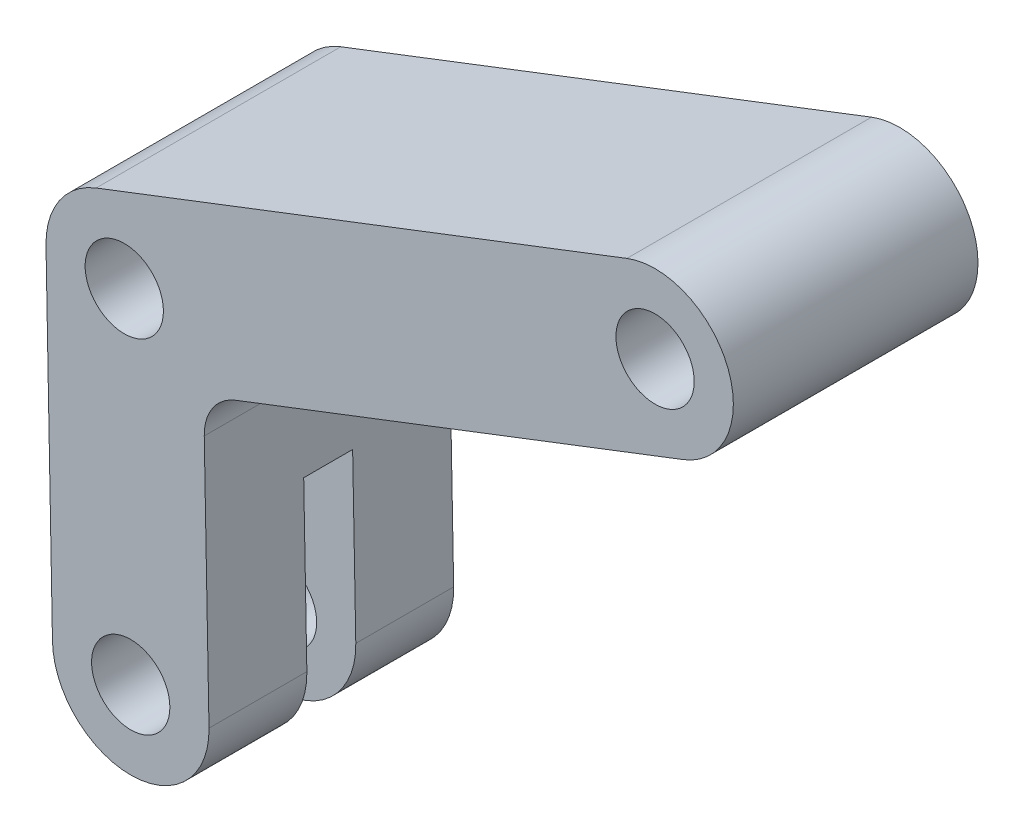
ISO-10303-21;
HEADER;
FILE_DESCRIPTION(('STEP AP214'),'2;1');
FILE_NAME('part.step','',(''),(''),'','','');
FILE_SCHEMA(('AUTOMOTIVE_DESIGN { 1 0 10303 214 1 1 1 1 }'));
ENDSEC;
DATA;
#1=APPLICATION_CONTEXT('core data for automotive mechanical design processes');
#2=APPLICATION_PROTOCOL_DEFINITION('international standard','automotive_design',2000,#1);
#3=PRODUCT_CONTEXT('',#1,'mechanical');
#4=PRODUCT('Part','Part','',(#3));
#5=PRODUCT_RELATED_PRODUCT_CATEGORY('part','',(#4));
#6=PRODUCT_DEFINITION_FORMATION('','',#4);
#7=PRODUCT_DEFINITION_CONTEXT('part definition',#1,'design');
#8=PRODUCT_DEFINITION('design','',#6,#7);
#9=PRODUCT_DEFINITION_SHAPE('','',#8);
#10=(LENGTH_UNIT() NAMED_UNIT(*) SI_UNIT(.MILLI.,.METRE.));
#11=(NAMED_UNIT(*) PLANE_ANGLE_UNIT() SI_UNIT($,.RADIAN.));
#12=(NAMED_UNIT(*) SI_UNIT($,.STERADIAN.) SOLID_ANGLE_UNIT());
#13=UNCERTAINTY_MEASURE_WITH_UNIT(LENGTH_MEASURE(1.E-05),#10,'distance_accuracy_value','');
#14=(GEOMETRIC_REPRESENTATION_CONTEXT(3) GLOBAL_UNCERTAINTY_ASSIGNED_CONTEXT((#13)) GLOBAL_UNIT_ASSIGNED_CONTEXT((#10,
#11,#12)) REPRESENTATION_CONTEXT('',''));
#15=CARTESIAN_POINT('',(0.,0.,0.));
#16=DIRECTION('',(0.,0.,1.));
#17=DIRECTION('',(1.,0.,0.));
#18=AXIS2_PLACEMENT_3D('',#15,#16,#17);
#19=CARTESIAN_POINT('',(0.,0.,-25.));
#20=DIRECTION('',(0.,0.,1.));
#21=DIRECTION('',(1.,0.,0.));
#22=AXIS2_PLACEMENT_3D('',#19,#20,#21);
#23=CYLINDRICAL_SURFACE('',#22,8.);
#24=CARTESIAN_POINT('',(0.,0.,-15.));
#25=DIRECTION('',(0.,0.,-1.));
#26=DIRECTION('',(0.,1.,0.));
#27=AXIS2_PLACEMENT_3D('',#24,#25,#26);
#28=CIRCLE('',#27,8.);
#29=CARTESIAN_POINT('',(-8.,0.,-15.));
#30=VERTEX_POINT('',#29);
#31=CARTESIAN_POINT('',(7.99855499034279,0.152046264217347,-15.));
#32=VERTEX_POINT('',#31);
#33=EDGE_CURVE('E156',#30,#32,#28,.F.);
#34=ORIENTED_EDGE('',*,*,#33,.F.);
#35=DIRECTION('',(0.,0.,1.));
#36=VECTOR('',#35,1.);
#37=CARTESIAN_POINT('',(-8.,0.,-25.));
#38=LINE('',#37,#36);
#39=CARTESIAN_POINT('',(-8.,0.,-25.));
#40=VERTEX_POINT('',#39);
#41=EDGE_CURVE('E220',#40,#30,#38,.T.);
#42=ORIENTED_EDGE('',*,*,#41,.F.);
#43=CARTESIAN_POINT('',(0.,0.,-25.));
#44=DIRECTION('',(0.,0.,1.));
#45=DIRECTION('',(1.,0.,0.));
#46=AXIS2_PLACEMENT_3D('',#43,#44,#45);
#47=CIRCLE('',#46,8.);
#48=CARTESIAN_POINT('',(7.99855499034279,0.152046264217347,-25.));
#49=VERTEX_POINT('',#48);
#50=EDGE_CURVE('E182',#40,#49,#47,.T.);
#51=ORIENTED_EDGE('',*,*,#50,.T.);
#52=DIRECTION('',(0.,0.,1.));
#53=VECTOR('',#52,1.);
#54=CARTESIAN_POINT('',(7.99855499034279,0.152046264217347,-25.));
#55=LINE('',#54,#53);
#56=EDGE_CURVE('E216',#49,#32,#55,.T.);
#57=ORIENTED_EDGE('',*,*,#56,.T.);
#58=EDGE_LOOP('',(#34,#42,#51,#57));
#59=FACE_BOUND('',#58,.T.);
#60=ADVANCED_FACE('F34',(#59),#23,.T.);
#61=CARTESIAN_POINT('',(0.,0.,-25.));
#62=DIRECTION('',(0.,0.,1.));
#63=DIRECTION('',(1.,0.,0.));
#64=AXIS2_PLACEMENT_3D('',#61,#62,#63);
#65=CYLINDRICAL_SURFACE('',#64,4.);
#66=CARTESIAN_POINT('',(0.,0.,-15.));
#67=DIRECTION('',(0.,0.,-1.));
#68=DIRECTION('',(0.,1.,0.));
#69=AXIS2_PLACEMENT_3D('',#66,#67,#68);
#70=CIRCLE('',#69,4.);
#71=CARTESIAN_POINT('',(0.,4.,-15.));
#72=VERTEX_POINT('',#71);
#73=EDGE_CURVE('E147',#72,#72,#70,.F.);
#74=ORIENTED_EDGE('',*,*,#73,.T.);
#75=EDGE_LOOP('',(#74));
#76=FACE_BOUND('',#75,.T.);
#77=CARTESIAN_POINT('',(0.,0.,-25.));
#78=DIRECTION('',(0.,0.,1.));
#79=DIRECTION('',(1.,0.,0.));
#80=AXIS2_PLACEMENT_3D('',#77,#78,#79);
#81=CIRCLE('',#80,4.);
#82=CARTESIAN_POINT('',(4.,0.,-25.));
#83=VERTEX_POINT('',#82);
#84=EDGE_CURVE('E159',#83,#83,#81,.T.);
#85=ORIENTED_EDGE('',*,*,#84,.F.);
#86=EDGE_LOOP('',(#85));
#87=FACE_BOUND('',#86,.T.);
#88=ADVANCED_FACE('F287',(#76,#87),#65,.F.);
#89=CARTESIAN_POINT('',(-8.85477215853256,22.9910407792631,-25.));
#90=DIRECTION('',(-0.359405611277905,0.9331814435478,0.));
#91=DIRECTION('',(-0.9331814435478,-0.359405611277905,0.));
#92=AXIS2_PLACEMENT_3D('',#89,#90,#91);
#93=PLANE('',#92);
#94=DIRECTION('',(-0.9331814435478,-0.359405611277905,0.));
#95=VECTOR('',#94,1.);
#96=CARTESIAN_POINT('',(-8.85477215853256,22.9910407792631,0.));
#97=LINE('',#96,#95);
#98=CARTESIAN_POINT('',(56.4552448902232,48.1445484516176,0.));
#99=VERTEX_POINT('',#98);
#100=CARTESIAN_POINT('',(10.7137090775173,30.5276479514807,0.));
#101=VERTEX_POINT('',#100);
#102=EDGE_CURVE('E197',#99,#101,#97,.T.);
#103=ORIENTED_EDGE('',*,*,#102,.T.);
#104=DIRECTION('',(0.,0.,1.));
#105=VECTOR('',#104,1.);
#106=CARTESIAN_POINT('',(10.7137090775173,30.5276479514807,-25.));
#107=LINE('',#106,#105);
#108=CARTESIAN_POINT('',(10.7137090775173,30.5276479514807,-25.));
#109=VERTEX_POINT('',#108);
#110=EDGE_CURVE('E57',#101,#109,#107,.F.);
#111=ORIENTED_EDGE('',*,*,#110,.T.);
#112=DIRECTION('',(-0.9331814435478,-0.359405611277905,0.));
#113=VECTOR('',#112,1.);
#114=CARTESIAN_POINT('',(-8.85477215853256,22.9910407792631,-25.));
#115=LINE('',#114,#113);
#116=CARTESIAN_POINT('',(56.4552448902232,48.1445484516176,-25.));
#117=VERTEX_POINT('',#116);
#118=EDGE_CURVE('E169',#117,#109,#115,.T.);
#119=ORIENTED_EDGE('',*,*,#118,.F.);
#120=DIRECTION('',(0.,0.,1.));
#121=VECTOR('',#120,1.);
#122=CARTESIAN_POINT('',(56.4552448902232,48.1445484516176,-25.));
#123=LINE('',#122,#121);
#124=EDGE_CURVE('E188',#117,#99,#123,.T.);
#125=ORIENTED_EDGE('',*,*,#124,.T.);
#126=EDGE_LOOP('',(#103,#111,#119,#125));
#127=FACE_BOUND('',#126,.T.);
#128=ADVANCED_FACE('F261',(#127),#93,.F.);
#129=CARTESIAN_POINT('',(7.99855499034279,0.152046264217347,-25.));
#130=DIRECTION('',(0.999819373792849,0.0190057830271684,0.));
#131=DIRECTION('',(-0.0190057830271684,0.999819373792849,0.));
#132=AXIS2_PLACEMENT_3D('',#129,#130,#131);
#133=PLANE('',#132);
#134=DIRECTION('',(-0.0190057830271684,0.999819373792849,0.));
#135=VECTOR('',#134,1.);
#136=CARTESIAN_POINT('',(7.99855499034279,0.152046264217349,-15.));
#137=LINE('',#136,#135);
#138=CARTESIAN_POINT('',(7.67545032388291,17.1493099301067,-15.));
#139=VERTEX_POINT('',#138);
#140=EDGE_CURVE('E136',#32,#139,#137,.T.);
#141=ORIENTED_EDGE('',*,*,#140,.F.);
#142=ORIENTED_EDGE('',*,*,#56,.F.);
#143=DIRECTION('',(-0.0190057830271684,0.999819373792849,0.));
#144=VECTOR('',#143,1.);
#145=CARTESIAN_POINT('',(7.99855499034279,0.152046264217347,-25.));
#146=LINE('',#145,#144);
#147=CARTESIAN_POINT('',(7.51164026494254,25.7667118186058,-25.));
#148=VERTEX_POINT('',#147);
#149=EDGE_CURVE('E185',#49,#148,#146,.T.);
#150=ORIENTED_EDGE('',*,*,#149,.T.);
#151=DIRECTION('',(0.,0.,1.));
#152=VECTOR('',#151,1.);
#153=CARTESIAN_POINT('',(7.51164026494254,25.7667118186058,-25.));
#154=LINE('',#153,#152);
#155=CARTESIAN_POINT('',(7.51164026494254,25.7667118186058,0.));
#156=VERTEX_POINT('',#155);
#157=EDGE_CURVE('E219',#148,#156,#154,.T.);
#158=ORIENTED_EDGE('',*,*,#157,.T.);
#159=DIRECTION('',(-0.0190057830271684,0.999819373792849,0.));
#160=VECTOR('',#159,1.);
#161=CARTESIAN_POINT('',(7.99855499034279,0.152046264217347,0.));
#162=LINE('',#161,#160);
#163=CARTESIAN_POINT('',(7.99855499034279,0.152046264217347,0.));
#164=VERTEX_POINT('',#163);
#165=EDGE_CURVE('E163',#164,#156,#162,.T.);
#166=ORIENTED_EDGE('',*,*,#165,.F.);
#167=CARTESIAN_POINT('',(7.99855499034279,0.152046264217347,-10.));
#168=VERTEX_POINT('',#167);
#169=EDGE_CURVE('E146',#168,#164,#55,.T.);
#170=ORIENTED_EDGE('',*,*,#169,.F.);
#171=DIRECTION('',(0.0190057830271684,-0.999819373792849,0.));
#172=VECTOR('',#171,1.);
#173=CARTESIAN_POINT('',(7.99855499034279,0.152046264217349,-10.));
#174=LINE('',#173,#172);
#175=CARTESIAN_POINT('',(7.67545032388291,17.1493099301067,-10.));
#176=VERTEX_POINT('',#175);
#177=EDGE_CURVE('E140',#176,#168,#174,.T.);
#178=ORIENTED_EDGE('',*,*,#177,.F.);
#179=DIRECTION('',(0.,0.,1.));
#180=VECTOR('',#179,1.);
#181=CARTESIAN_POINT('',(7.67545032388291,17.1493099301067,-25.));
#182=LINE('',#181,#180);
#183=EDGE_CURVE('E126',#139,#176,#182,.T.);
#184=ORIENTED_EDGE('',*,*,#183,.F.);
#185=EDGE_LOOP('',(#141,#142,#150,#158,#166,#170,#178,#184));
#186=FACE_BOUND('',#185,.T.);
#187=ADVANCED_FACE('F144',(#186),#133,.T.);
#188=CARTESIAN_POINT('',(0.,0.,-10.));
#189=DIRECTION('',(0.,0.,1.));
#190=DIRECTION('',(0.,-1.,0.));
#191=AXIS2_PLACEMENT_3D('',#188,#189,#190);
#192=CIRCLE('',#191,8.);
#193=CARTESIAN_POINT('',(-8.,0.,-10.));
#194=VERTEX_POINT('',#193);
#195=EDGE_CURVE('E49',#168,#194,#192,.F.);
#196=ORIENTED_EDGE('',*,*,#195,.F.);
#197=ORIENTED_EDGE('',*,*,#169,.T.);
#198=CARTESIAN_POINT('',(0.,0.,0.));
#199=DIRECTION('',(0.,0.,1.));
#200=DIRECTION('',(1.,0.,0.));
#201=AXIS2_PLACEMENT_3D('',#198,#199,#200);
#202=CIRCLE('',#201,8.);
#203=CARTESIAN_POINT('',(-8.,0.,0.));
#204=VERTEX_POINT('',#203);
#205=EDGE_CURVE('E211',#204,#164,#202,.T.);
#206=ORIENTED_EDGE('',*,*,#205,.F.);
#207=EDGE_CURVE('E223',#194,#204,#38,.T.);
#208=ORIENTED_EDGE('',*,*,#207,.F.);
#209=EDGE_LOOP('',(#196,#197,#206,#208));
#210=FACE_BOUND('',#209,.T.);
#211=ADVANCED_FACE('F277',(#210),#23,.T.);
#212=CARTESIAN_POINT('',(-7.99709752059199,-0.152352915552517,-25.));
#213=DIRECTION('',(0.999818578580134,0.0190475700812738,0.));
#214=DIRECTION('',(-0.0190475700812738,0.999818578580134,0.));
#215=AXIS2_PLACEMENT_3D('',#212,#213,#214);
#216=PLANE('',#215);
#217=ORIENTED_EDGE('',*,*,#41,.T.);
#218=DIRECTION('',(-0.0190475700812738,0.999818578580134,0.));
#219=VECTOR('',#218,1.);
#220=CARTESIAN_POINT('',(-7.99709752059199,-0.152352915552516,-15.));
#221=LINE('',#220,#219);
#222=CARTESIAN_POINT('',(-8.32090621197365,16.8445629203098,-15.));
#223=VERTEX_POINT('',#222);
#224=EDGE_CURVE('E150',#30,#223,#221,.T.);
#225=ORIENTED_EDGE('',*,*,#224,.T.);
#226=DIRECTION('',(0.,0.,1.));
#227=VECTOR('',#226,1.);
#228=CARTESIAN_POINT('',(-8.32090621197365,16.8445629203098,-25.));
#229=LINE('',#228,#227);
#230=CARTESIAN_POINT('',(-8.32090621197365,16.8445629203098,-10.));
#231=VERTEX_POINT('',#230);
#232=EDGE_CURVE('E11',#223,#231,#229,.T.);
#233=ORIENTED_EDGE('',*,*,#232,.T.);
#234=DIRECTION('',(0.0190475700812738,-0.999818578580134,0.));
#235=VECTOR('',#234,1.);
#236=CARTESIAN_POINT('',(-7.99709752059199,-0.152352915552515,-10.));
#237=LINE('',#236,#235);
#238=EDGE_CURVE('E141',#231,#194,#237,.T.);
#239=ORIENTED_EDGE('',*,*,#238,.T.);
#240=ORIENTED_EDGE('',*,*,#207,.T.);
#241=DIRECTION('',(-0.0190475700812738,0.999818578580134,0.));
#242=VECTOR('',#241,1.);
#243=CARTESIAN_POINT('',(-7.99709752059199,-0.152352915552517,0.));
#244=LINE('',#243,#242);
#245=CARTESIAN_POINT('',(-8.65854862864108,34.5676194393498,0.));
#246=VERTEX_POINT('',#245);
#247=EDGE_CURVE('E208',#204,#246,#244,.T.);
#248=ORIENTED_EDGE('',*,*,#247,.T.);
#249=DIRECTION('',(0.,0.,1.));
#250=VECTOR('',#249,1.);
#251=CARTESIAN_POINT('',(-8.65854862864108,34.5676194393498,-25.));
#252=LINE('',#251,#250);
#253=CARTESIAN_POINT('',(-8.65854862864108,34.5676194393498,-25.));
#254=VERTEX_POINT('',#253);
#255=EDGE_CURVE('E224',#254,#246,#252,.T.);
#256=ORIENTED_EDGE('',*,*,#255,.F.);
#257=DIRECTION('',(-0.0190475700812738,0.999818578580134,0.));
#258=VECTOR('',#257,1.);
#259=CARTESIAN_POINT('',(-7.99709752059199,-0.152352915552517,-25.));
#260=LINE('',#259,#258);
#261=EDGE_CURVE('E180',#40,#254,#260,.T.);
#262=ORIENTED_EDGE('',*,*,#261,.F.);
#263=EDGE_LOOP('',(#217,#225,#233,#239,#240,#248,#256,#262));
#264=FACE_BOUND('',#263,.T.);
#265=ADVANCED_FACE('F247',(#264),#216,.F.);
#266=CARTESIAN_POINT('',(-0.660000000000004,34.72,-25.));
#267=DIRECTION('',(0.,0.,1.));
#268=DIRECTION('',(1.,0.,0.));
#269=AXIS2_PLACEMENT_3D('',#266,#267,#268);
#270=CYLINDRICAL_SURFACE('',#269,7.99999999999999);
#271=CARTESIAN_POINT('',(-0.660000000000004,34.72,0.));
#272=DIRECTION('',(0.,0.,1.));
#273=DIRECTION('',(1.,0.,0.));
#274=AXIS2_PLACEMENT_3D('',#271,#272,#273);
#275=CIRCLE('',#274,7.99999999999999);
#276=CARTESIAN_POINT('',(-3.53524489022324,42.1854515483824,0.));
#277=VERTEX_POINT('',#276);
#278=EDGE_CURVE('E205',#277,#246,#275,.T.);
#279=ORIENTED_EDGE('',*,*,#278,.F.);
#280=DIRECTION('',(0.,0.,1.));
#281=VECTOR('',#280,1.);
#282=CARTESIAN_POINT('',(-3.53524489022324,42.1854515483824,-25.));
#283=LINE('',#282,#281);
#284=CARTESIAN_POINT('',(-3.53524489022324,42.1854515483824,-25.));
#285=VERTEX_POINT('',#284);
#286=EDGE_CURVE('E226',#285,#277,#283,.T.);
#287=ORIENTED_EDGE('',*,*,#286,.F.);
#288=CARTESIAN_POINT('',(-0.660000000000004,34.72,-25.));
#289=DIRECTION('',(0.,0.,1.));
#290=DIRECTION('',(1.,0.,0.));
#291=AXIS2_PLACEMENT_3D('',#288,#289,#290);
#292=CIRCLE('',#291,7.99999999999999);
#293=EDGE_CURVE('E177',#285,#254,#292,.T.);
#294=ORIENTED_EDGE('',*,*,#293,.T.);
#295=ORIENTED_EDGE('',*,*,#255,.T.);
#296=EDGE_LOOP('',(#279,#287,#294,#295));
#297=FACE_BOUND('',#296,.T.);
#298=ADVANCED_FACE('F273',(#297),#270,.T.);
#299=CARTESIAN_POINT('',(-14.605261938979,37.9219438760279,-25.));
#300=DIRECTION('',(-0.359405611277905,0.9331814435478,0.));
#301=DIRECTION('',(-0.9331814435478,-0.359405611277905,0.));
#302=AXIS2_PLACEMENT_3D('',#299,#300,#301);
#303=PLANE('',#302);
#304=DIRECTION('',(-0.9331814435478,-0.359405611277905,0.));
#305=VECTOR('',#304,1.);
#306=CARTESIAN_POINT('',(-14.605261938979,37.9219438760279,0.));
#307=LINE('',#306,#305);
#308=CARTESIAN_POINT('',(50.7047551097767,63.0754515483824,0.));
#309=VERTEX_POINT('',#308);
#310=EDGE_CURVE('E202',#309,#277,#307,.T.);
#311=ORIENTED_EDGE('',*,*,#310,.F.);
#312=DIRECTION('',(0.,0.,1.));
#313=VECTOR('',#312,1.);
#314=CARTESIAN_POINT('',(50.7047551097767,63.0754515483824,-25.));
#315=LINE('',#314,#313);
#316=CARTESIAN_POINT('',(50.7047551097767,63.0754515483824,-25.));
#317=VERTEX_POINT('',#316);
#318=EDGE_CURVE('E228',#317,#309,#315,.T.);
#319=ORIENTED_EDGE('',*,*,#318,.F.);
#320=DIRECTION('',(-0.9331814435478,-0.359405611277905,0.));
#321=VECTOR('',#320,1.);
#322=CARTESIAN_POINT('',(-14.605261938979,37.9219438760279,-25.));
#323=LINE('',#322,#321);
#324=EDGE_CURVE('E174',#317,#285,#323,.T.);
#325=ORIENTED_EDGE('',*,*,#324,.T.);
#326=ORIENTED_EDGE('',*,*,#286,.T.);
#327=EDGE_LOOP('',(#311,#319,#325,#326));
#328=FACE_BOUND('',#327,.T.);
#329=ADVANCED_FACE('F269',(#328),#303,.T.);
#330=CARTESIAN_POINT('',(53.58,55.61,-25.));
#331=DIRECTION('',(0.,0.,1.));
#332=DIRECTION('',(1.,0.,0.));
#333=AXIS2_PLACEMENT_3D('',#330,#331,#332);
#334=CYLINDRICAL_SURFACE('',#333,4.00000000000001);
#335=CARTESIAN_POINT('',(53.58,55.61,-25.));
#336=DIRECTION('',(0.,0.,1.));
#337=DIRECTION('',(1.,0.,0.));
#338=AXIS2_PLACEMENT_3D('',#335,#336,#337);
#339=CIRCLE('',#338,4.00000000000001);
#340=CARTESIAN_POINT('',(57.58,55.61,-25.));
#341=VERTEX_POINT('',#340);
#342=EDGE_CURVE('E166',#341,#341,#339,.T.);
#343=ORIENTED_EDGE('',*,*,#342,.F.);
#344=EDGE_LOOP('',(#343));
#345=FACE_BOUND('',#344,.T.);
#346=CARTESIAN_POINT('',(53.58,55.61,0.));
#347=DIRECTION('',(0.,0.,1.));
#348=DIRECTION('',(1.,0.,0.));
#349=AXIS2_PLACEMENT_3D('',#346,#347,#348);
#350=CIRCLE('',#349,4.00000000000001);
#351=CARTESIAN_POINT('',(57.58,55.61,0.));
#352=VERTEX_POINT('',#351);
#353=EDGE_CURVE('E194',#352,#352,#350,.T.);
#354=ORIENTED_EDGE('',*,*,#353,.T.);
#355=EDGE_LOOP('',(#354));
#356=FACE_BOUND('',#355,.T.);
#357=ADVANCED_FACE('F307',(#345,#356),#334,.F.);
#358=CARTESIAN_POINT('',(-0.660000000000004,34.72,-25.));
#359=DIRECTION('',(0.,0.,1.));
#360=DIRECTION('',(1.,0.,0.));
#361=AXIS2_PLACEMENT_3D('',#358,#359,#360);
#362=CYLINDRICAL_SURFACE('',#361,4.);
#363=CARTESIAN_POINT('',(-0.660000000000004,34.72,-25.));
#364=DIRECTION('',(0.,0.,1.));
#365=DIRECTION('',(1.,0.,0.));
#366=AXIS2_PLACEMENT_3D('',#363,#364,#365);
#367=CIRCLE('',#366,4.);
#368=CARTESIAN_POINT('',(3.34,34.72,-25.));
#369=VERTEX_POINT('',#368);
#370=EDGE_CURVE('E162',#369,#369,#367,.T.);
#371=ORIENTED_EDGE('',*,*,#370,.F.);
#372=EDGE_LOOP('',(#371));
#373=FACE_BOUND('',#372,.T.);
#374=CARTESIAN_POINT('',(-0.660000000000004,34.72,0.));
#375=DIRECTION('',(0.,0.,1.));
#376=DIRECTION('',(1.,0.,0.));
#377=AXIS2_PLACEMENT_3D('',#374,#375,#376);
#378=CIRCLE('',#377,4.);
#379=CARTESIAN_POINT('',(3.34,34.72,0.));
#380=VERTEX_POINT('',#379);
#381=EDGE_CURVE('E191',#380,#380,#378,.T.);
#382=ORIENTED_EDGE('',*,*,#381,.T.);
#383=EDGE_LOOP('',(#382));
#384=FACE_BOUND('',#383,.T.);
#385=ADVANCED_FACE('F300',(#373,#384),#362,.F.);
#386=CARTESIAN_POINT('',(0.,0.,-10.));
#387=DIRECTION('',(0.,0.,1.));
#388=DIRECTION('',(0.,-1.,0.));
#389=AXIS2_PLACEMENT_3D('',#386,#387,#388);
#390=CIRCLE('',#389,4.);
#391=CARTESIAN_POINT('',(0.,-4.,-10.));
#392=VERTEX_POINT('',#391);
#393=EDGE_CURVE('E237',#392,#392,#390,.F.);
#394=ORIENTED_EDGE('',*,*,#393,.T.);
#395=EDGE_LOOP('',(#394));
#396=FACE_BOUND('',#395,.T.);
#397=CARTESIAN_POINT('',(0.,0.,0.));
#398=DIRECTION('',(0.,0.,1.));
#399=DIRECTION('',(1.,0.,0.));
#400=AXIS2_PLACEMENT_3D('',#397,#398,#399);
#401=CIRCLE('',#400,4.);
#402=CARTESIAN_POINT('',(4.,0.,0.));
#403=VERTEX_POINT('',#402);
#404=EDGE_CURVE('E135',#403,#403,#401,.T.);
#405=ORIENTED_EDGE('',*,*,#404,.T.);
#406=EDGE_LOOP('',(#405));
#407=FACE_BOUND('',#406,.T.);
#408=ADVANCED_FACE('F292',(#396,#407),#65,.F.);
#409=CARTESIAN_POINT('',(53.58,55.61,-25.));
#410=DIRECTION('',(0.,0.,1.));
#411=DIRECTION('',(1.,0.,0.));
#412=AXIS2_PLACEMENT_3D('',#409,#410,#411);
#413=CYLINDRICAL_SURFACE('',#412,8.);
#414=CARTESIAN_POINT('',(53.58,55.61,0.));
#415=DIRECTION('',(0.,0.,1.));
#416=DIRECTION('',(1.,0.,0.));
#417=AXIS2_PLACEMENT_3D('',#414,#415,#416);
#418=CIRCLE('',#417,8.);
#419=EDGE_CURVE('E199',#99,#309,#418,.T.);
#420=ORIENTED_EDGE('',*,*,#419,.F.);
#421=ORIENTED_EDGE('',*,*,#124,.F.);
#422=CARTESIAN_POINT('',(53.58,55.61,-25.));
#423=DIRECTION('',(0.,0.,1.));
#424=DIRECTION('',(1.,0.,0.));
#425=AXIS2_PLACEMENT_3D('',#422,#423,#424);
#426=CIRCLE('',#425,8.);
#427=EDGE_CURVE('E171',#117,#317,#426,.T.);
#428=ORIENTED_EDGE('',*,*,#427,.T.);
#429=ORIENTED_EDGE('',*,*,#318,.T.);
#430=EDGE_LOOP('',(#420,#421,#428,#429));
#431=FACE_BOUND('',#430,.T.);
#432=ADVANCED_FACE('F264',(#431),#413,.T.);
#433=CARTESIAN_POINT('',(0.,0.,-25.));
#434=DIRECTION('',(0.,0.,1.));
#435=DIRECTION('',(1.,0.,0.));
#436=AXIS2_PLACEMENT_3D('',#433,#434,#435);
#437=PLANE('',#436);
#438=ORIENTED_EDGE('',*,*,#84,.T.);
#439=EDGE_LOOP('',(#438));
#440=FACE_BOUND('',#439,.T.);
#441=ORIENTED_EDGE('',*,*,#370,.T.);
#442=EDGE_LOOP('',(#441));
#443=FACE_BOUND('',#442,.T.);
#444=ORIENTED_EDGE('',*,*,#342,.T.);
#445=EDGE_LOOP('',(#444));
#446=FACE_BOUND('',#445,.T.);
#447=ORIENTED_EDGE('',*,*,#118,.T.);
#448=CARTESIAN_POINT('',(12.5107371339068,25.8617407337417,-25.));
#449=DIRECTION('',(0.,0.,1.));
#450=DIRECTION('',(1.,0.,0.));
#451=AXIS2_PLACEMENT_3D('',#448,#449,#450);
#452=CIRCLE('',#451,5.);
#453=EDGE_CURVE('E42',#109,#148,#452,.T.);
#454=ORIENTED_EDGE('',*,*,#453,.T.);
#455=ORIENTED_EDGE('',*,*,#149,.F.);
#456=ORIENTED_EDGE('',*,*,#50,.F.);
#457=ORIENTED_EDGE('',*,*,#261,.T.);
#458=ORIENTED_EDGE('',*,*,#293,.F.);
#459=ORIENTED_EDGE('',*,*,#324,.F.);
#460=ORIENTED_EDGE('',*,*,#427,.F.);
#461=EDGE_LOOP('',(#447,#454,#455,#456,#457,#458,#459,#460));
#462=FACE_BOUND('',#461,.T.);
#463=ADVANCED_FACE('F305',(#440,#443,#446,#462),#437,.F.);
#464=CARTESIAN_POINT('',(0.,0.,0.));
#465=DIRECTION('',(0.,0.,1.));
#466=DIRECTION('',(1.,0.,0.));
#467=AXIS2_PLACEMENT_3D('',#464,#465,#466);
#468=PLANE('',#467);
#469=ORIENTED_EDGE('',*,*,#404,.F.);
#470=EDGE_LOOP('',(#469));
#471=FACE_BOUND('',#470,.T.);
#472=ORIENTED_EDGE('',*,*,#381,.F.);
#473=EDGE_LOOP('',(#472));
#474=FACE_BOUND('',#473,.T.);
#475=ORIENTED_EDGE('',*,*,#353,.F.);
#476=EDGE_LOOP('',(#475));
#477=FACE_BOUND('',#476,.T.);
#478=ORIENTED_EDGE('',*,*,#102,.F.);
#479=ORIENTED_EDGE('',*,*,#419,.T.);
#480=ORIENTED_EDGE('',*,*,#310,.T.);
#481=ORIENTED_EDGE('',*,*,#278,.T.);
#482=ORIENTED_EDGE('',*,*,#247,.F.);
#483=ORIENTED_EDGE('',*,*,#205,.T.);
#484=ORIENTED_EDGE('',*,*,#165,.T.);
#485=CARTESIAN_POINT('',(12.5107371339068,25.8617407337417,0.));
#486=DIRECTION('',(0.,0.,1.));
#487=DIRECTION('',(1.,0.,0.));
#488=AXIS2_PLACEMENT_3D('',#485,#486,#487);
#489=CIRCLE('',#488,5.);
#490=EDGE_CURVE('E234',#156,#101,#489,.F.);
#491=ORIENTED_EDGE('',*,*,#490,.T.);
#492=EDGE_LOOP('',(#478,#479,#480,#481,#482,#483,#484,#491));
#493=FACE_BOUND('',#492,.T.);
#494=ADVANCED_FACE('F259',(#471,#474,#477,#493),#468,.T.);
#495=CARTESIAN_POINT('',(12.5107371339068,25.8617407337417,-25.));
#496=DIRECTION('',(0.,0.,1.));
#497=DIRECTION('',(1.,0.,0.));
#498=AXIS2_PLACEMENT_3D('',#495,#496,#497);
#499=CYLINDRICAL_SURFACE('',#498,5.);
#500=ORIENTED_EDGE('',*,*,#453,.F.);
#501=ORIENTED_EDGE('',*,*,#110,.F.);
#502=ORIENTED_EDGE('',*,*,#490,.F.);
#503=ORIENTED_EDGE('',*,*,#157,.F.);
#504=EDGE_LOOP('',(#500,#501,#502,#503));
#505=FACE_BOUND('',#504,.T.);
#506=ADVANCED_FACE('F36',(#505),#499,.F.);
#507=CARTESIAN_POINT('',(62.4452455931621,18.1927307427207,-15.));
#508=DIRECTION('',(-0.0190475700812738,0.999818578580134,0.));
#509=DIRECTION('',(-0.999818578580134,-0.0190475700812738,0.));
#510=AXIS2_PLACEMENT_3D('',#507,#508,#509);
#511=PLANE('',#510);
#512=ORIENTED_EDGE('',*,*,#183,.T.);
#513=DIRECTION('',(-0.999818578580134,-0.0190475700812738,0.));
#514=VECTOR('',#513,1.);
#515=CARTESIAN_POINT('',(62.4452455931621,18.1927307427207,-10.));
#516=LINE('',#515,#514);
#517=EDGE_CURVE('E129',#176,#231,#516,.T.);
#518=ORIENTED_EDGE('',*,*,#517,.T.);
#519=ORIENTED_EDGE('',*,*,#232,.F.);
#520=DIRECTION('',(-0.999818578580134,-0.0190475700812738,0.));
#521=VECTOR('',#520,1.);
#522=CARTESIAN_POINT('',(62.4452455931621,18.1927307427207,-15.));
#523=LINE('',#522,#521);
#524=EDGE_CURVE('E131',#139,#223,#523,.T.);
#525=ORIENTED_EDGE('',*,*,#524,.F.);
#526=EDGE_LOOP('',(#512,#518,#519,#525));
#527=FACE_BOUND('',#526,.T.);
#528=ADVANCED_FACE('F128',(#527),#511,.F.);
#529=CARTESIAN_POINT('',(62.4452455931621,18.1927307427207,-15.));
#530=DIRECTION('',(0.,0.,-1.));
#531=DIRECTION('',(0.,1.,0.));
#532=AXIS2_PLACEMENT_3D('',#529,#530,#531);
#533=PLANE('',#532);
#534=ORIENTED_EDGE('',*,*,#140,.T.);
#535=ORIENTED_EDGE('',*,*,#524,.T.);
#536=ORIENTED_EDGE('',*,*,#224,.F.);
#537=ORIENTED_EDGE('',*,*,#33,.T.);
#538=EDGE_LOOP('',(#534,#535,#536,#537));
#539=FACE_BOUND('',#538,.T.);
#540=ORIENTED_EDGE('',*,*,#73,.F.);
#541=EDGE_LOOP('',(#540));
#542=FACE_BOUND('',#541,.T.);
#543=ADVANCED_FACE('F243',(#539,#542),#533,.F.);
#544=CARTESIAN_POINT('',(62.4452455931621,18.1927307427207,-10.));
#545=DIRECTION('',(0.,0.,1.));
#546=DIRECTION('',(0.,-1.,0.));
#547=AXIS2_PLACEMENT_3D('',#544,#545,#546);
#548=PLANE('',#547);
#549=ORIENTED_EDGE('',*,*,#177,.T.);
#550=ORIENTED_EDGE('',*,*,#195,.T.);
#551=ORIENTED_EDGE('',*,*,#238,.F.);
#552=ORIENTED_EDGE('',*,*,#517,.F.);
#553=EDGE_LOOP('',(#549,#550,#551,#552));
#554=FACE_BOUND('',#553,.T.);
#555=ORIENTED_EDGE('',*,*,#393,.F.);
#556=EDGE_LOOP('',(#555));
#557=FACE_BOUND('',#556,.T.);
#558=ADVANCED_FACE('F138',(#554,#557),#548,.F.);
#559=CLOSED_SHELL('',(#60,#88,#128,#187,#211,#265,#298,#329,#357,#385,#408,#432,#463,#494,#506,
#528,#543,#558));
#560=MANIFOLD_SOLID_BREP('B2',#559);
#561=ADVANCED_BREP_SHAPE_REPRESENTATION('',(#18,#560),#14);
#562=SHAPE_DEFINITION_REPRESENTATION(#9,#561);
ENDSEC;
END-ISO-10303-21;
